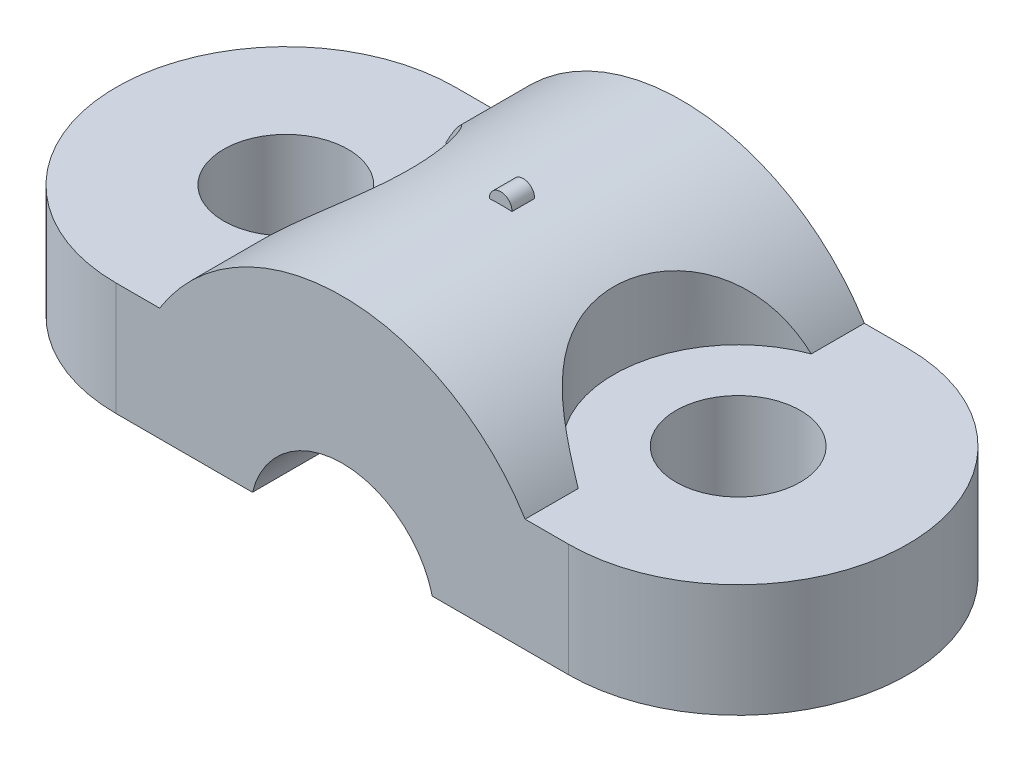
ISO-10303-21;
HEADER;
FILE_DESCRIPTION(('STEP AP214'),'2;1');
FILE_NAME('part.step','',(''),(''),'','','');
FILE_SCHEMA(('AUTOMOTIVE_DESIGN { 1 0 10303 214 1 1 1 1 }'));
ENDSEC;
DATA;
#1=APPLICATION_CONTEXT('core data for automotive mechanical design processes');
#2=APPLICATION_PROTOCOL_DEFINITION('international standard','automotive_design',2000,#1);
#3=PRODUCT_CONTEXT('',#1,'mechanical');
#4=PRODUCT('Part','Part','',(#3));
#5=PRODUCT_RELATED_PRODUCT_CATEGORY('part','',(#4));
#6=PRODUCT_DEFINITION_FORMATION('','',#4);
#7=PRODUCT_DEFINITION_CONTEXT('part definition',#1,'design');
#8=PRODUCT_DEFINITION('design','',#6,#7);
#9=PRODUCT_DEFINITION_SHAPE('','',#8);
#10=(LENGTH_UNIT() NAMED_UNIT(*) SI_UNIT(.MILLI.,.METRE.));
#11=(NAMED_UNIT(*) PLANE_ANGLE_UNIT() SI_UNIT($,.RADIAN.));
#12=(NAMED_UNIT(*) SI_UNIT($,.STERADIAN.) SOLID_ANGLE_UNIT());
#13=UNCERTAINTY_MEASURE_WITH_UNIT(LENGTH_MEASURE(1.E-05),#10,'distance_accuracy_value','');
#14=(GEOMETRIC_REPRESENTATION_CONTEXT(3) GLOBAL_UNCERTAINTY_ASSIGNED_CONTEXT((#13)) GLOBAL_UNIT_ASSIGNED_CONTEXT((#10,
#11,#12)) REPRESENTATION_CONTEXT('',''));
#15=CARTESIAN_POINT('',(0.,0.,0.));
#16=DIRECTION('',(0.,0.,1.));
#17=DIRECTION('',(1.,0.,0.));
#18=AXIS2_PLACEMENT_3D('',#15,#16,#17);
#19=CARTESIAN_POINT('',(0.,0.,0.));
#20=DIRECTION('',(0.,1.,0.));
#21=DIRECTION('',(0.,0.,1.));
#22=AXIS2_PLACEMENT_3D('',#19,#20,#21);
#23=PLANE('',#22);
#24=CARTESIAN_POINT('',(-10.,0.,0.));
#25=DIRECTION('',(0.,1.,0.));
#26=DIRECTION('',(0.,0.,1.));
#27=AXIS2_PLACEMENT_3D('',#24,#25,#26);
#28=CIRCLE('',#27,2.75);
#29=CARTESIAN_POINT('',(-10.,0.,2.75));
#30=VERTEX_POINT('',#29);
#31=EDGE_CURVE('E216',#30,#30,#28,.T.);
#32=ORIENTED_EDGE('',*,*,#31,.T.);
#33=EDGE_LOOP('',(#32));
#34=FACE_BOUND('',#33,.T.);
#35=DIRECTION('',(1.,0.,0.));
#36=VECTOR('',#35,1.);
#37=CARTESIAN_POINT('',(0.,0.,-7.5));
#38=LINE('',#37,#36);
#39=CARTESIAN_POINT('',(-10.,0.,-7.5));
#40=VERTEX_POINT('',#39);
#41=CARTESIAN_POINT('',(-3.97617907041421,0.,-7.5));
#42=VERTEX_POINT('',#41);
#43=EDGE_CURVE('E199',#40,#42,#38,.T.);
#44=ORIENTED_EDGE('',*,*,#43,.T.);
#45=DIRECTION('',(0.,0.,1.));
#46=VECTOR('',#45,1.);
#47=CARTESIAN_POINT('',(-3.97617907041421,0.,-7.5));
#48=LINE('',#47,#46);
#49=CARTESIAN_POINT('',(-3.97617907041421,0.,7.5));
#50=VERTEX_POINT('',#49);
#51=EDGE_CURVE('E148',#42,#50,#48,.T.);
#52=ORIENTED_EDGE('',*,*,#51,.T.);
#53=DIRECTION('',(1.,0.,0.));
#54=VECTOR('',#53,1.);
#55=CARTESIAN_POINT('',(0.,0.,7.5));
#56=LINE('',#55,#54);
#57=CARTESIAN_POINT('',(-10.,0.,7.5));
#58=VERTEX_POINT('',#57);
#59=EDGE_CURVE('E11',#58,#50,#56,.T.);
#60=ORIENTED_EDGE('',*,*,#59,.F.);
#61=CARTESIAN_POINT('',(-10.,0.,0.));
#62=DIRECTION('',(0.,1.,0.));
#63=DIRECTION('',(0.,0.,1.));
#64=AXIS2_PLACEMENT_3D('',#61,#62,#63);
#65=CIRCLE('',#64,7.5);
#66=EDGE_CURVE('E208',#40,#58,#65,.T.);
#67=ORIENTED_EDGE('',*,*,#66,.F.);
#68=EDGE_LOOP('',(#44,#52,#60,#67));
#69=FACE_BOUND('',#68,.T.);
#70=ADVANCED_FACE('F35',(#34,#69),#23,.F.);
#71=CARTESIAN_POINT('',(0.,9.5,-7.5));
#72=DIRECTION('',(0.,0.,-1.));
#73=DIRECTION('',(-1.,0.,0.));
#74=AXIS2_PLACEMENT_3D('',#71,#72,#73);
#75=PLANE('',#74);
#76=CARTESIAN_POINT('',(0.,-0.999999999999999,-7.5));
#77=DIRECTION('',(0.,0.,1.));
#78=DIRECTION('',(1.,0.,0.));
#79=AXIS2_PLACEMENT_3D('',#76,#77,#78);
#80=CIRCLE('',#79,4.1);
#81=CARTESIAN_POINT('',(3.97617907041421,0.,-7.5));
#82=VERTEX_POINT('',#81);
#83=EDGE_CURVE('E143',#82,#42,#80,.T.);
#84=ORIENTED_EDGE('',*,*,#83,.T.);
#85=ORIENTED_EDGE('',*,*,#43,.F.);
#86=DIRECTION('',(0.,-1.,0.));
#87=VECTOR('',#86,1.);
#88=CARTESIAN_POINT('',(-10.,5.,-7.5));
#89=LINE('',#88,#87);
#90=CARTESIAN_POINT('',(-10.,5.,-7.5));
#91=VERTEX_POINT('',#90);
#92=EDGE_CURVE('E209',#91,#40,#89,.T.);
#93=ORIENTED_EDGE('',*,*,#92,.F.);
#94=DIRECTION('',(1.,0.,0.));
#95=VECTOR('',#94,1.);
#96=CARTESIAN_POINT('',(0.,5.,-7.5));
#97=LINE('',#96,#95);
#98=CARTESIAN_POINT('',(-8.08,5.,-7.5));
#99=VERTEX_POINT('',#98);
#100=EDGE_CURVE('E229',#91,#99,#97,.T.);
#101=ORIENTED_EDGE('',*,*,#100,.T.);
#102=CARTESIAN_POINT('',(0.,-0.00404444444444992,-7.5));
#103=DIRECTION('',(0.,0.,1.));
#104=DIRECTION('',(1.,0.,0.));
#105=AXIS2_PLACEMENT_3D('',#102,#103,#104);
#106=CIRCLE('',#105,9.50404444444445);
#107=CARTESIAN_POINT('',(8.08,5.,-7.5));
#108=VERTEX_POINT('',#107);
#109=EDGE_CURVE('E159',#99,#108,#106,.F.);
#110=ORIENTED_EDGE('',*,*,#109,.T.);
#111=DIRECTION('',(1.,0.,0.));
#112=VECTOR('',#111,1.);
#113=CARTESIAN_POINT('',(0.,5.,-7.5));
#114=LINE('',#113,#112);
#115=CARTESIAN_POINT('',(10.,5.,-7.5));
#116=VERTEX_POINT('',#115);
#117=EDGE_CURVE('E250',#108,#116,#114,.T.);
#118=ORIENTED_EDGE('',*,*,#117,.T.);
#119=DIRECTION('',(0.,-1.,0.));
#120=VECTOR('',#119,1.);
#121=CARTESIAN_POINT('',(10.,5.,-7.5));
#122=LINE('',#121,#120);
#123=CARTESIAN_POINT('',(10.,0.,-7.5));
#124=VERTEX_POINT('',#123);
#125=EDGE_CURVE('E240',#116,#124,#122,.T.);
#126=ORIENTED_EDGE('',*,*,#125,.T.);
#127=EDGE_CURVE('E202',#82,#124,#38,.T.);
#128=ORIENTED_EDGE('',*,*,#127,.F.);
#129=EDGE_LOOP('',(#84,#85,#93,#101,#110,#118,#126,#128));
#130=FACE_BOUND('',#129,.T.);
#131=ADVANCED_FACE('F188',(#130),#75,.T.);
#132=CARTESIAN_POINT('',(0.,9.5,7.5));
#133=DIRECTION('',(0.,0.,-1.));
#134=DIRECTION('',(-1.,0.,0.));
#135=AXIS2_PLACEMENT_3D('',#132,#133,#134);
#136=PLANE('',#135);
#137=ORIENTED_EDGE('',*,*,#59,.T.);
#138=CARTESIAN_POINT('',(0.,-0.999999999999999,7.5));
#139=DIRECTION('',(0.,0.,1.));
#140=DIRECTION('',(1.,0.,0.));
#141=AXIS2_PLACEMENT_3D('',#138,#139,#140);
#142=CIRCLE('',#141,4.1);
#143=CARTESIAN_POINT('',(3.97617907041421,0.,7.5));
#144=VERTEX_POINT('',#143);
#145=EDGE_CURVE('E142',#144,#50,#142,.T.);
#146=ORIENTED_EDGE('',*,*,#145,.F.);
#147=CARTESIAN_POINT('',(10.,0.,7.5));
#148=VERTEX_POINT('',#147);
#149=EDGE_CURVE('E44',#144,#148,#56,.T.);
#150=ORIENTED_EDGE('',*,*,#149,.T.);
#151=DIRECTION('',(0.,-1.,0.));
#152=VECTOR('',#151,1.);
#153=CARTESIAN_POINT('',(10.,5.,7.5));
#154=LINE('',#153,#152);
#155=CARTESIAN_POINT('',(10.,5.,7.5));
#156=VERTEX_POINT('',#155);
#157=EDGE_CURVE('E221',#156,#148,#154,.T.);
#158=ORIENTED_EDGE('',*,*,#157,.F.);
#159=DIRECTION('',(1.,0.,0.));
#160=VECTOR('',#159,1.);
#161=CARTESIAN_POINT('',(0.,5.,7.5));
#162=LINE('',#161,#160);
#163=CARTESIAN_POINT('',(8.08,5.,7.5));
#164=VERTEX_POINT('',#163);
#165=EDGE_CURVE('E255',#164,#156,#162,.T.);
#166=ORIENTED_EDGE('',*,*,#165,.F.);
#167=CARTESIAN_POINT('',(0.,-0.00404444444444992,7.5));
#168=DIRECTION('',(0.,0.,1.));
#169=DIRECTION('',(1.,0.,0.));
#170=AXIS2_PLACEMENT_3D('',#167,#168,#169);
#171=CIRCLE('',#170,9.50404444444445);
#172=CARTESIAN_POINT('',(-8.08,5.,7.5));
#173=VERTEX_POINT('',#172);
#174=EDGE_CURVE('E158',#173,#164,#171,.F.);
#175=ORIENTED_EDGE('',*,*,#174,.F.);
#176=DIRECTION('',(1.,0.,0.));
#177=VECTOR('',#176,1.);
#178=CARTESIAN_POINT('',(0.,5.,7.5));
#179=LINE('',#178,#177);
#180=CARTESIAN_POINT('',(-10.,5.,7.5));
#181=VERTEX_POINT('',#180);
#182=EDGE_CURVE('E224',#181,#173,#179,.T.);
#183=ORIENTED_EDGE('',*,*,#182,.F.);
#184=DIRECTION('',(0.,-1.,0.));
#185=VECTOR('',#184,1.);
#186=CARTESIAN_POINT('',(-10.,5.,7.5));
#187=LINE('',#186,#185);
#188=EDGE_CURVE('E212',#181,#58,#187,.T.);
#189=ORIENTED_EDGE('',*,*,#188,.T.);
#190=EDGE_LOOP('',(#137,#146,#150,#158,#166,#175,#183,#189));
#191=FACE_BOUND('',#190,.T.);
#192=ADVANCED_FACE('F186',(#191),#136,.F.);
#193=CARTESIAN_POINT('',(10.,9.5,0.));
#194=DIRECTION('',(0.,-1.,0.));
#195=DIRECTION('',(0.,0.,-1.));
#196=AXIS2_PLACEMENT_3D('',#193,#194,#195);
#197=CYLINDRICAL_SURFACE('',#196,5.5);
#198=CARTESIAN_POINT('',(8.08,5.,5.1539887465923));
#199=CARTESIAN_POINT('',(7.99001563173181,5.14537029095498,5.12045202710558));
#200=CARTESIAN_POINT('',(7.89642080027451,5.2876648416954,5.08291490139109));
#201=CARTESIAN_POINT('',(7.70303619143883,5.56538729143438,4.99851462898592));
#202=CARTESIAN_POINT('',(7.60323825023025,5.70080569622129,4.95163900523841));
#203=CARTESIAN_POINT('',(7.39822899975281,5.96429797844464,4.84706858689315));
#204=CARTESIAN_POINT('',(7.29299392446025,6.09233332444659,4.78932275124168));
#205=CARTESIAN_POINT('',(7.07919423812253,6.33933866324696,4.66201228546329));
#206=CARTESIAN_POINT('',(6.97063158823109,6.4583138569845,4.59245451114239));
#207=CARTESIAN_POINT('',(6.77002561898331,6.66761599596033,4.45304749354069));
#208=CARTESIAN_POINT('',(6.67820013118659,6.75943742939677,4.38512546358434));
#209=CARTESIAN_POINT('',(6.49483287498101,6.93570850535153,4.23998448771444));
#210=CARTESIAN_POINT('',(6.4032910581131,7.02015948250038,4.16276723101617));
#211=CARTESIAN_POINT('',(6.22213791783691,7.18111426267204,3.99907706653871));
#212=CARTESIAN_POINT('',(6.13252200680799,7.25763913011599,3.91262999964637));
#213=CARTESIAN_POINT('',(5.95643697117863,7.40275908901513,3.7303687540728));
#214=CARTESIAN_POINT('',(5.86996780136252,7.47135429444287,3.63455471005909));
#215=CARTESIAN_POINT('',(5.70124719644635,7.60082296141688,3.43337170240056));
#216=CARTESIAN_POINT('',(5.61901839949237,7.66165711328524,3.32795839865091));
#217=CARTESIAN_POINT('',(5.46068184982798,7.77524301032143,3.10851985876541));
#218=CARTESIAN_POINT('',(5.38457425746823,7.8279945437903,2.99449439717768));
#219=CARTESIAN_POINT('',(5.23974783889334,7.92561771971182,2.75847560664738));
#220=CARTESIAN_POINT('',(5.17103605829657,7.97048187357141,2.63647485476747));
#221=CARTESIAN_POINT('',(5.04226321935938,8.05252280833811,2.3855256402096));
#222=CARTESIAN_POINT('',(4.98220169755516,8.08970000114394,2.25657755026534));
#223=CARTESIAN_POINT('',(4.87569571840315,8.15426707913313,2.00227913158619));
#224=CARTESIAN_POINT('',(4.82858229536027,8.18216883107698,1.87733791764317));
#225=CARTESIAN_POINT('',(4.7432772156176,8.23189039517921,1.62321717296968));
#226=CARTESIAN_POINT('',(4.70508867416853,8.25370808419313,1.49403618022434));
#227=CARTESIAN_POINT('',(4.63817572488957,8.29147622530342,1.23249757882539));
#228=CARTESIAN_POINT('',(4.60944532943068,8.30743039014418,1.10014203703577));
#229=CARTESIAN_POINT('',(4.56176669780388,8.33369431090743,0.833080930764921));
#230=CARTESIAN_POINT('',(4.5428218951031,8.34400208575988,0.698374558563418));
#231=CARTESIAN_POINT('',(4.51503828462937,8.35906135478321,0.428380394727918));
#232=CARTESIAN_POINT('',(4.50614357629464,8.36384358648628,0.293100062555013));
#233=CARTESIAN_POINT('',(4.49837528890235,8.36802222045578,0.0221690513639427));
#234=CARTESIAN_POINT('',(4.49950170082585,8.36741862756942,-0.113481627320805));
#235=CARTESIAN_POINT('',(4.51176368608058,8.36081643472608,-0.38422471554139));
#236=CARTESIAN_POINT('',(4.52290120430723,8.35481678645693,-0.519317011474745));
#237=CARTESIAN_POINT('',(4.55505038849556,8.33734097223021,-0.787916170946606));
#238=CARTESIAN_POINT('',(4.57605862016963,8.32586671101677,-0.921423569362649));
#239=CARTESIAN_POINT('',(4.62781292988375,8.29722570836424,-1.1865638287248));
#240=CARTESIAN_POINT('',(4.6586034271825,8.28003298351272,-1.31818521911614));
#241=CARTESIAN_POINT('',(4.72949049511725,8.23976776054407,-1.57792413672532));
#242=CARTESIAN_POINT('',(4.7695835890645,8.21669745875729,-1.70604295302427));
#243=CARTESIAN_POINT('',(4.85856357954256,8.16442428944372,-1.95792604850737));
#244=CARTESIAN_POINT('',(4.90745190221837,8.13522042723227,-2.0816896175919));
#245=CARTESIAN_POINT('',(5.01334827876581,8.07042458381926,-2.32395800884918));
#246=CARTESIAN_POINT('',(5.07035625249683,8.03483266566663,-2.44246288290989));
#247=CARTESIAN_POINT('',(5.19132819405616,7.95724331145843,-2.67273122361642));
#248=CARTESIAN_POINT('',(5.25525007007142,7.91528407191326,-2.7845296835744));
#249=CARTESIAN_POINT('',(5.38938362745487,7.82461791597135,-3.00141201562999));
#250=CARTESIAN_POINT('',(5.45959524542943,7.77591106758035,-3.10649595538424));
#251=CARTESIAN_POINT('',(5.6051944297775,7.67167449225916,-3.30926716864003));
#252=CARTESIAN_POINT('',(5.68057711881361,7.61615115661414,-3.40696123419716));
#253=CARTESIAN_POINT('',(5.83547574864086,7.49819261477784,-3.59465579730305));
#254=CARTESIAN_POINT('',(5.91499314997896,7.43575495724966,-3.68465354610437));
#255=CARTESIAN_POINT('',(6.07793913790115,7.30325823694817,-3.85768486544204));
#256=CARTESIAN_POINT('',(6.16140331673655,7.23311637598895,-3.94062141037416));
#257=CARTESIAN_POINT('',(6.33012485404885,7.086012440228,-4.09821250960134));
#258=CARTESIAN_POINT('',(6.41538237096791,7.00904976085756,-4.17286632842706));
#259=CARTESIAN_POINT('',(6.58670164493307,6.84840333431155,-4.31413384543037));
#260=CARTESIAN_POINT('',(6.67276477776184,6.76470488678345,-4.38072911800364));
#261=CARTESIAN_POINT('',(6.84439122105345,6.59111047836797,-4.50593131531683));
#262=CARTESIAN_POINT('',(6.92995461226864,6.50121555060063,-4.56453956688047));
#263=CARTESIAN_POINT('',(7.11039937051045,6.30381993408541,-4.68115048657111));
#264=CARTESIAN_POINT('',(7.20508286045697,6.1955337381665,-4.73812944608902));
#265=CARTESIAN_POINT('',(7.39139372656363,5.97218594834049,-4.84320317212035));
#266=CARTESIAN_POINT('',(7.48302002866022,5.85712201170591,-4.8912948426942));
#267=CARTESIAN_POINT('',(7.66177586574647,5.62141615772103,-4.97921645036869));
#268=CARTESIAN_POINT('',(7.74892334902326,5.50080089762206,-5.01908167299271));
#269=CARTESIAN_POINT('',(7.91830939750818,5.2542538569602,-5.0916615235222));
#270=CARTESIAN_POINT('',(8.00055221110987,5.12832684372751,-5.12438240717257));
#271=CARTESIAN_POINT('',(8.08,5.,-5.15398874659229));
#272=B_SPLINE_CURVE_WITH_KNOTS('',3,(#198,#199,#200,#201,#202,#203,#204,#205,#206,#207,#208,
#209,#210,#211,#212,#213,#214,#215,#216,#217,#218,#219,#220,#221,#222,#223,#224,#225,#226,#227,
#228,#229,#230,#231,#232,#233,#234,#235,#236,#237,#238,#239,#240,#241,#242,#243,#244,#245,#246,
#247,#248,#249,#250,#251,#252,#253,#254,#255,#256,#257,#258,#259,#260,#261,#262,#263,#264,#265,
#266,#267,#268,#269,#270,#271),.UNSPECIFIED.,.F.,.F.,(4,2,2,2,2,2,2,2,2,2,2,2,2,2,2,2,2,2,2,2,2,
2,2,2,2,2,2,2,2,2,2,2,2,2,2,2,4),(0.,0.522671156148208,1.04604538796136,1.57194135890126,
2.09753312963723,2.5367327541687,2.97585268340231,3.41377393017173,3.85168888194289,
4.29174054629022,4.73180373444884,5.17228250589281,5.61273766856725,6.02148927877775,
6.430383352304,6.83901806893623,7.24779606584504,7.65428899213027,8.06078155257461,
8.46735310093515,8.87378329671269,9.28208603941171,9.69023643093759,10.0984530637356,
10.5066656677327,10.9125197880747,11.3183698183164,11.7238421801669,12.1294587572976,
12.5399647620607,12.9505071888116,13.3619712478386,13.7733668698959,14.237049740574,
14.7008938346784,15.1627050054456,15.624110167645),.UNSPECIFIED.);
#273=CARTESIAN_POINT('',(8.08,5.,5.15398874659229));
#274=VERTEX_POINT('',#273);
#275=CARTESIAN_POINT('',(8.08,5.,-5.15398874659229));
#276=VERTEX_POINT('',#275);
#277=EDGE_CURVE('E151',#274,#276,#272,.T.);
#278=ORIENTED_EDGE('',*,*,#277,.F.);
#279=CARTESIAN_POINT('',(10.,5.,0.));
#280=DIRECTION('',(0.,1.,0.));
#281=DIRECTION('',(0.,0.,1.));
#282=AXIS2_PLACEMENT_3D('',#279,#280,#281);
#283=CIRCLE('',#282,5.5);
#284=EDGE_CURVE('E258',#276,#274,#283,.T.);
#285=ORIENTED_EDGE('',*,*,#284,.F.);
#286=EDGE_LOOP('',(#278,#285));
#287=FACE_BOUND('',#286,.T.);
#288=ADVANCED_FACE('F37',(#287),#197,.F.);
#289=CARTESIAN_POINT('',(-10.,9.5,0.));
#290=DIRECTION('',(0.,-1.,0.));
#291=DIRECTION('',(0.,0.,-1.));
#292=AXIS2_PLACEMENT_3D('',#289,#290,#291);
#293=CYLINDRICAL_SURFACE('',#292,5.5);
#294=CARTESIAN_POINT('',(-8.08,5.,-5.15398874659229));
#295=CARTESIAN_POINT('',(-7.99001563173182,5.14537029095499,-5.12045202710558));
#296=CARTESIAN_POINT('',(-7.89642080027452,5.28766484169541,-5.08291490139109));
#297=CARTESIAN_POINT('',(-7.70303619143883,5.56538729143438,-4.99851462898592));
#298=CARTESIAN_POINT('',(-7.60323825023026,5.7008056962213,-4.95163900523841));
#299=CARTESIAN_POINT('',(-7.39822899975281,5.96429797844465,-4.84706858689314));
#300=CARTESIAN_POINT('',(-7.29299392446025,6.09233332444659,-4.78932275124168));
#301=CARTESIAN_POINT('',(-7.07919423812253,6.33933866324696,-4.66201228546328));
#302=CARTESIAN_POINT('',(-6.9706315882311,6.45831385698451,-4.59245451114239));
#303=CARTESIAN_POINT('',(-6.77002561898331,6.66761599596033,-4.45304749354069));
#304=CARTESIAN_POINT('',(-6.67820013118659,6.75943742939678,-4.38512546358434));
#305=CARTESIAN_POINT('',(-6.49483287498101,6.93570850535153,-4.23998448771444));
#306=CARTESIAN_POINT('',(-6.4032910581131,7.02015948250038,-4.16276723101617));
#307=CARTESIAN_POINT('',(-6.22213791783691,7.18111426267204,-3.9990770665387));
#308=CARTESIAN_POINT('',(-6.13252200680799,7.25763913011599,-3.91262999964637));
#309=CARTESIAN_POINT('',(-5.95643697117864,7.40275908901513,-3.7303687540728));
#310=CARTESIAN_POINT('',(-5.86996780136253,7.47135429444287,-3.63455471005909));
#311=CARTESIAN_POINT('',(-5.70124719644635,7.60082296141688,-3.43337170240056));
#312=CARTESIAN_POINT('',(-5.61901839949237,7.66165711328524,-3.32795839865091));
#313=CARTESIAN_POINT('',(-5.46068184982799,7.77524301032144,-3.10851985876541));
#314=CARTESIAN_POINT('',(-5.38457425746824,7.8279945437903,-2.99449439717768));
#315=CARTESIAN_POINT('',(-5.23974783889334,7.92561771971182,-2.75847560664738));
#316=CARTESIAN_POINT('',(-5.17103605829658,7.97048187357141,-2.63647485476747));
#317=CARTESIAN_POINT('',(-5.04226321935938,8.05252280833811,-2.3855256402096));
#318=CARTESIAN_POINT('',(-4.98220169755516,8.08970000114394,-2.25657755026534));
#319=CARTESIAN_POINT('',(-4.87569571840315,8.15426707913313,-2.0022791315862));
#320=CARTESIAN_POINT('',(-4.82858229536027,8.18216883107698,-1.87733791764317));
#321=CARTESIAN_POINT('',(-4.74327721561761,8.23189039517922,-1.62321717296969));
#322=CARTESIAN_POINT('',(-4.70508867416853,8.25370808419313,-1.49403618022434));
#323=CARTESIAN_POINT('',(-4.63817572488957,8.29147622530342,-1.2324975788254));
#324=CARTESIAN_POINT('',(-4.60944532943068,8.30743039014418,-1.10014203703578));
#325=CARTESIAN_POINT('',(-4.56176669780389,8.33369431090743,-0.833080930764929));
#326=CARTESIAN_POINT('',(-4.5428218951031,8.34400208575988,-0.698374558563427));
#327=CARTESIAN_POINT('',(-4.51503828462937,8.35906135478321,-0.428380394727927));
#328=CARTESIAN_POINT('',(-4.50614357629464,8.36384358648628,-0.293100062555022));
#329=CARTESIAN_POINT('',(-4.49837528890235,8.36802222045578,-0.0221690513639521));
#330=CARTESIAN_POINT('',(-4.49950170082585,8.36741862756942,0.113481627320795));
#331=CARTESIAN_POINT('',(-4.51176368608058,8.36081643472609,0.384224715541381));
#332=CARTESIAN_POINT('',(-4.52290120430723,8.35481678645693,0.519317011474737));
#333=CARTESIAN_POINT('',(-4.55505038849556,8.33734097223022,0.787916170946599));
#334=CARTESIAN_POINT('',(-4.57605862016964,8.32586671101678,0.921423569362642));
#335=CARTESIAN_POINT('',(-4.62781292988375,8.29722570836424,1.18656382872479));
#336=CARTESIAN_POINT('',(-4.6586034271825,8.28003298351273,1.31818521911613));
#337=CARTESIAN_POINT('',(-4.72949049511725,8.23976776054407,1.57792413672531));
#338=CARTESIAN_POINT('',(-4.7695835890645,8.21669745875729,1.70604295302426));
#339=CARTESIAN_POINT('',(-4.85856357954256,8.16442428944372,1.95792604850737));
#340=CARTESIAN_POINT('',(-4.90745190221837,8.13522042723227,2.08168961759189));
#341=CARTESIAN_POINT('',(-5.01334827876581,8.07042458381927,2.32395800884917));
#342=CARTESIAN_POINT('',(-5.07035625249683,8.03483266566664,2.44246288290988));
#343=CARTESIAN_POINT('',(-5.19132819405616,7.95724331145843,2.67273122361641));
#344=CARTESIAN_POINT('',(-5.25525007007141,7.91528407191326,2.7845296835744));
#345=CARTESIAN_POINT('',(-5.38938362745487,7.82461791597136,3.00141201562998));
#346=CARTESIAN_POINT('',(-5.45959524542943,7.77591106758036,3.10649595538423));
#347=CARTESIAN_POINT('',(-5.6051944297775,7.67167449225917,3.30926716864003));
#348=CARTESIAN_POINT('',(-5.68057711881361,7.61615115661414,3.40696123419715));
#349=CARTESIAN_POINT('',(-5.83547574864086,7.49819261477785,3.59465579730305));
#350=CARTESIAN_POINT('',(-5.91499314997896,7.43575495724967,3.68465354610436));
#351=CARTESIAN_POINT('',(-6.07793913790115,7.30325823694818,3.85768486544203));
#352=CARTESIAN_POINT('',(-6.16140331673655,7.23311637598896,3.94062141037416));
#353=CARTESIAN_POINT('',(-6.33012485404885,7.086012440228,4.09821250960133));
#354=CARTESIAN_POINT('',(-6.4153823709679,7.00904976085757,4.17286632842706));
#355=CARTESIAN_POINT('',(-6.58670164493307,6.84840333431156,4.31413384543037));
#356=CARTESIAN_POINT('',(-6.67276477776184,6.76470488678345,4.38072911800364));
#357=CARTESIAN_POINT('',(-6.84439122105345,6.59111047836798,4.50593131531683));
#358=CARTESIAN_POINT('',(-6.92995461226863,6.50121555060064,4.56453956688047));
#359=CARTESIAN_POINT('',(-7.11039937051045,6.30381993408542,4.68115048657111));
#360=CARTESIAN_POINT('',(-7.20508286045697,6.19553373816651,4.73812944608902));
#361=CARTESIAN_POINT('',(-7.39139372656363,5.9721859483405,4.84320317212035));
#362=CARTESIAN_POINT('',(-7.48302002866022,5.85712201170592,4.8912948426942));
#363=CARTESIAN_POINT('',(-7.66177586574647,5.62141615772104,4.97921645036869));
#364=CARTESIAN_POINT('',(-7.74892334902326,5.50080089762206,5.01908167299271));
#365=CARTESIAN_POINT('',(-7.91830939750818,5.25425385696021,5.0916615235222));
#366=CARTESIAN_POINT('',(-8.00055221110987,5.12832684372751,5.12438240717257));
#367=CARTESIAN_POINT('',(-8.08,5.,5.15398874659229));
#368=B_SPLINE_CURVE_WITH_KNOTS('',3,(#294,#295,#296,#297,#298,#299,#300,#301,#302,#303,#304,
#305,#306,#307,#308,#309,#310,#311,#312,#313,#314,#315,#316,#317,#318,#319,#320,#321,#322,#323,
#324,#325,#326,#327,#328,#329,#330,#331,#332,#333,#334,#335,#336,#337,#338,#339,#340,#341,#342,
#343,#344,#345,#346,#347,#348,#349,#350,#351,#352,#353,#354,#355,#356,#357,#358,#359,#360,#361,
#362,#363,#364,#365,#366,#367),.UNSPECIFIED.,.F.,.F.,(4,2,2,2,2,2,2,2,2,2,2,2,2,2,2,2,2,2,2,2,2,
2,2,2,2,2,2,2,2,2,2,2,2,2,2,2,4),(0.,0.522671156148207,1.04604538796136,1.57194135890126,
2.09753312963723,2.53673275416869,2.9758526834023,3.41377393017173,3.85168888194288,
4.29174054629021,4.73180373444883,5.1722825058928,5.61273766856724,6.02148927877773,
6.43038335230398,6.83901806893622,7.24779606584503,7.65428899213026,8.0607815525746,
8.46735310093514,8.87378329671268,9.2820860394117,9.69023643093758,10.0984530637356,
10.5066656677327,10.9125197880747,11.3183698183164,11.7238421801669,12.1294587572976,
12.5399647620607,12.9505071888116,13.3619712478386,13.7733668698959,14.237049740574,
14.7008938346784,15.1627050054456,15.624110167645),.UNSPECIFIED.);
#369=CARTESIAN_POINT('',(-8.08,5.,-5.15398874659229));
#370=VERTEX_POINT('',#369);
#371=CARTESIAN_POINT('',(-8.08,5.,5.15398874659229));
#372=VERTEX_POINT('',#371);
#373=EDGE_CURVE('E171',#370,#372,#368,.T.);
#374=ORIENTED_EDGE('',*,*,#373,.F.);
#375=CARTESIAN_POINT('',(-10.,5.,0.));
#376=DIRECTION('',(0.,1.,0.));
#377=DIRECTION('',(0.,0.,1.));
#378=AXIS2_PLACEMENT_3D('',#375,#376,#377);
#379=CIRCLE('',#378,5.5);
#380=EDGE_CURVE('E234',#372,#370,#379,.T.);
#381=ORIENTED_EDGE('',*,*,#380,.F.);
#382=EDGE_LOOP('',(#374,#381));
#383=FACE_BOUND('',#382,.T.);
#384=ADVANCED_FACE('F180',(#383),#293,.F.);
#385=ORIENTED_EDGE('',*,*,#149,.F.);
#386=DIRECTION('',(0.,0.,1.));
#387=VECTOR('',#386,1.);
#388=CARTESIAN_POINT('',(3.97617907041421,0.,-7.5));
#389=LINE('',#388,#387);
#390=EDGE_CURVE('E146',#82,#144,#389,.T.);
#391=ORIENTED_EDGE('',*,*,#390,.F.);
#392=ORIENTED_EDGE('',*,*,#127,.T.);
#393=CARTESIAN_POINT('',(10.,0.,0.));
#394=DIRECTION('',(0.,1.,0.));
#395=DIRECTION('',(0.,0.,1.));
#396=AXIS2_PLACEMENT_3D('',#393,#394,#395);
#397=CIRCLE('',#396,7.5);
#398=EDGE_CURVE('E177',#148,#124,#397,.T.);
#399=ORIENTED_EDGE('',*,*,#398,.F.);
#400=EDGE_LOOP('',(#385,#391,#392,#399));
#401=FACE_BOUND('',#400,.T.);
#402=CARTESIAN_POINT('',(10.,0.,0.));
#403=DIRECTION('',(0.,1.,0.));
#404=DIRECTION('',(0.,0.,1.));
#405=AXIS2_PLACEMENT_3D('',#402,#403,#404);
#406=CIRCLE('',#405,2.75);
#407=CARTESIAN_POINT('',(10.,0.,2.75));
#408=VERTEX_POINT('',#407);
#409=EDGE_CURVE('E243',#408,#408,#406,.T.);
#410=ORIENTED_EDGE('',*,*,#409,.T.);
#411=EDGE_LOOP('',(#410));
#412=FACE_BOUND('',#411,.T.);
#413=ADVANCED_FACE('F184',(#401,#412),#23,.F.);
#414=CARTESIAN_POINT('',(-10.,5.,0.));
#415=DIRECTION('',(0.,-1.,0.));
#416=DIRECTION('',(0.,0.,-1.));
#417=AXIS2_PLACEMENT_3D('',#414,#415,#416);
#418=CYLINDRICAL_SURFACE('',#417,7.5);
#419=ORIENTED_EDGE('',*,*,#66,.T.);
#420=ORIENTED_EDGE('',*,*,#188,.F.);
#421=CARTESIAN_POINT('',(-10.,5.,0.));
#422=DIRECTION('',(0.,1.,0.));
#423=DIRECTION('',(0.,0.,1.));
#424=AXIS2_PLACEMENT_3D('',#421,#422,#423);
#425=CIRCLE('',#424,7.5);
#426=EDGE_CURVE('E227',#91,#181,#425,.T.);
#427=ORIENTED_EDGE('',*,*,#426,.F.);
#428=ORIENTED_EDGE('',*,*,#92,.T.);
#429=EDGE_LOOP('',(#419,#420,#427,#428));
#430=FACE_BOUND('',#429,.T.);
#431=ADVANCED_FACE('F284',(#430),#418,.T.);
#432=CARTESIAN_POINT('',(-10.,5.,0.));
#433=DIRECTION('',(0.,-1.,0.));
#434=DIRECTION('',(0.,0.,-1.));
#435=AXIS2_PLACEMENT_3D('',#432,#433,#434);
#436=CYLINDRICAL_SURFACE('',#435,2.75);
#437=CARTESIAN_POINT('',(-10.,5.,0.));
#438=DIRECTION('',(0.,1.,0.));
#439=DIRECTION('',(0.,0.,1.));
#440=AXIS2_PLACEMENT_3D('',#437,#438,#439);
#441=CIRCLE('',#440,2.75);
#442=CARTESIAN_POINT('',(-10.,5.,2.75));
#443=VERTEX_POINT('',#442);
#444=EDGE_CURVE('E215',#443,#443,#441,.T.);
#445=ORIENTED_EDGE('',*,*,#444,.T.);
#446=EDGE_LOOP('',(#445));
#447=FACE_BOUND('',#446,.T.);
#448=ORIENTED_EDGE('',*,*,#31,.F.);
#449=EDGE_LOOP('',(#448));
#450=FACE_BOUND('',#449,.T.);
#451=ADVANCED_FACE('F292',(#447,#450),#436,.F.);
#452=CARTESIAN_POINT('',(0.,5.,0.));
#453=DIRECTION('',(0.,1.,0.));
#454=DIRECTION('',(0.,0.,1.));
#455=AXIS2_PLACEMENT_3D('',#452,#453,#454);
#456=PLANE('',#455);
#457=ORIENTED_EDGE('',*,*,#444,.F.);
#458=EDGE_LOOP('',(#457));
#459=FACE_BOUND('',#458,.T.);
#460=DIRECTION('',(0.,0.,1.));
#461=VECTOR('',#460,1.);
#462=CARTESIAN_POINT('',(-8.08,5.,0.));
#463=LINE('',#462,#461);
#464=EDGE_CURVE('E219',#372,#173,#463,.T.);
#465=ORIENTED_EDGE('',*,*,#464,.F.);
#466=ORIENTED_EDGE('',*,*,#380,.T.);
#467=DIRECTION('',(0.,0.,1.));
#468=VECTOR('',#467,1.);
#469=CARTESIAN_POINT('',(-8.08,5.,0.));
#470=LINE('',#469,#468);
#471=EDGE_CURVE('E232',#99,#370,#470,.T.);
#472=ORIENTED_EDGE('',*,*,#471,.F.);
#473=ORIENTED_EDGE('',*,*,#100,.F.);
#474=ORIENTED_EDGE('',*,*,#426,.T.);
#475=ORIENTED_EDGE('',*,*,#182,.T.);
#476=EDGE_LOOP('',(#465,#466,#472,#473,#474,#475));
#477=FACE_BOUND('',#476,.T.);
#478=ADVANCED_FACE('F300',(#459,#477),#456,.T.);
#479=CARTESIAN_POINT('',(10.,5.,0.));
#480=DIRECTION('',(0.,-1.,0.));
#481=DIRECTION('',(0.,0.,-1.));
#482=AXIS2_PLACEMENT_3D('',#479,#480,#481);
#483=CYLINDRICAL_SURFACE('',#482,7.5);
#484=ORIENTED_EDGE('',*,*,#398,.T.);
#485=ORIENTED_EDGE('',*,*,#125,.F.);
#486=CARTESIAN_POINT('',(10.,5.,0.));
#487=DIRECTION('',(0.,1.,0.));
#488=DIRECTION('',(0.,0.,1.));
#489=AXIS2_PLACEMENT_3D('',#486,#487,#488);
#490=CIRCLE('',#489,7.5);
#491=EDGE_CURVE('E253',#156,#116,#490,.T.);
#492=ORIENTED_EDGE('',*,*,#491,.F.);
#493=ORIENTED_EDGE('',*,*,#157,.T.);
#494=EDGE_LOOP('',(#484,#485,#492,#493));
#495=FACE_BOUND('',#494,.T.);
#496=ADVANCED_FACE('F308',(#495),#483,.T.);
#497=CARTESIAN_POINT('',(10.,5.,0.));
#498=DIRECTION('',(0.,-1.,0.));
#499=DIRECTION('',(0.,0.,-1.));
#500=AXIS2_PLACEMENT_3D('',#497,#498,#499);
#501=CYLINDRICAL_SURFACE('',#500,2.75);
#502=CARTESIAN_POINT('',(10.,5.,0.));
#503=DIRECTION('',(0.,1.,0.));
#504=DIRECTION('',(0.,0.,1.));
#505=AXIS2_PLACEMENT_3D('',#502,#503,#504);
#506=CIRCLE('',#505,2.75);
#507=CARTESIAN_POINT('',(10.,5.,2.75));
#508=VERTEX_POINT('',#507);
#509=EDGE_CURVE('E242',#508,#508,#506,.T.);
#510=ORIENTED_EDGE('',*,*,#509,.T.);
#511=EDGE_LOOP('',(#510));
#512=FACE_BOUND('',#511,.T.);
#513=ORIENTED_EDGE('',*,*,#409,.F.);
#514=EDGE_LOOP('',(#513));
#515=FACE_BOUND('',#514,.T.);
#516=ADVANCED_FACE('F316',(#512,#515),#501,.F.);
#517=CARTESIAN_POINT('',(0.,5.,0.));
#518=DIRECTION('',(0.,1.,0.));
#519=DIRECTION('',(0.,0.,1.));
#520=AXIS2_PLACEMENT_3D('',#517,#518,#519);
#521=PLANE('',#520);
#522=ORIENTED_EDGE('',*,*,#509,.F.);
#523=EDGE_LOOP('',(#522));
#524=FACE_BOUND('',#523,.T.);
#525=DIRECTION('',(0.,0.,1.));
#526=VECTOR('',#525,1.);
#527=CARTESIAN_POINT('',(8.08,5.,0.));
#528=LINE('',#527,#526);
#529=EDGE_CURVE('E178',#108,#276,#528,.T.);
#530=ORIENTED_EDGE('',*,*,#529,.T.);
#531=ORIENTED_EDGE('',*,*,#284,.T.);
#532=DIRECTION('',(0.,0.,-1.));
#533=VECTOR('',#532,1.);
#534=CARTESIAN_POINT('',(8.08,5.,0.));
#535=LINE('',#534,#533);
#536=EDGE_CURVE('E257',#164,#274,#535,.T.);
#537=ORIENTED_EDGE('',*,*,#536,.F.);
#538=ORIENTED_EDGE('',*,*,#165,.T.);
#539=ORIENTED_EDGE('',*,*,#491,.T.);
#540=ORIENTED_EDGE('',*,*,#117,.F.);
#541=EDGE_LOOP('',(#530,#531,#537,#538,#539,#540));
#542=FACE_BOUND('',#541,.T.);
#543=ADVANCED_FACE('F166',(#524,#542),#521,.T.);
#544=CARTESIAN_POINT('',(0.,-0.00404444444444992,-7.5));
#545=DIRECTION('',(0.,0.,1.));
#546=DIRECTION('',(1.,0.,0.));
#547=AXIS2_PLACEMENT_3D('',#544,#545,#546);
#548=CYLINDRICAL_SURFACE('',#547,9.50404444444445);
#549=DIRECTION('',(0.,0.,-1.));
#550=VECTOR('',#549,1.);
#551=CARTESIAN_POINT('',(0.499826987192359,9.48684770460295,0.5));
#552=LINE('',#551,#550);
#553=CARTESIAN_POINT('',(0.499826987192355,9.48684770460295,0.5));
#554=VERTEX_POINT('',#553);
#555=CARTESIAN_POINT('',(0.499826987192359,9.48684770460295,-0.5));
#556=VERTEX_POINT('',#555);
#557=EDGE_CURVE('E56',#554,#556,#552,.T.);
#558=ORIENTED_EDGE('',*,*,#557,.F.);
#559=CARTESIAN_POINT('',(0.,-0.00404444444444992,0.5));
#560=DIRECTION('',(0.,0.,1.));
#561=DIRECTION('',(1.,0.,0.));
#562=AXIS2_PLACEMENT_3D('',#559,#560,#561);
#563=CIRCLE('',#562,9.50404444444445);
#564=CARTESIAN_POINT('',(-0.499826987192359,9.48684770460295,0.5));
#565=VERTEX_POINT('',#564);
#566=EDGE_CURVE('E51',#554,#565,#563,.T.);
#567=ORIENTED_EDGE('',*,*,#566,.T.);
#568=DIRECTION('',(0.,0.,-1.));
#569=VECTOR('',#568,1.);
#570=CARTESIAN_POINT('',(-0.499826987192363,9.48684770460295,0.5));
#571=LINE('',#570,#569);
#572=CARTESIAN_POINT('',(-0.499826987192363,9.48684770460295,-0.5));
#573=VERTEX_POINT('',#572);
#574=EDGE_CURVE('E122',#565,#573,#571,.T.);
#575=ORIENTED_EDGE('',*,*,#574,.T.);
#576=CARTESIAN_POINT('',(0.,-0.00404444444444992,-0.5));
#577=DIRECTION('',(0.,0.,1.));
#578=DIRECTION('',(1.,0.,0.));
#579=AXIS2_PLACEMENT_3D('',#576,#577,#578);
#580=CIRCLE('',#579,9.50404444444445);
#581=EDGE_CURVE('E127',#556,#573,#580,.T.);
#582=ORIENTED_EDGE('',*,*,#581,.F.);
#583=EDGE_LOOP('',(#558,#567,#575,#582));
#584=FACE_BOUND('',#583,.T.);
#585=ORIENTED_EDGE('',*,*,#373,.T.);
#586=ORIENTED_EDGE('',*,*,#464,.T.);
#587=ORIENTED_EDGE('',*,*,#174,.T.);
#588=ORIENTED_EDGE('',*,*,#536,.T.);
#589=ORIENTED_EDGE('',*,*,#277,.T.);
#590=ORIENTED_EDGE('',*,*,#529,.F.);
#591=ORIENTED_EDGE('',*,*,#109,.F.);
#592=ORIENTED_EDGE('',*,*,#471,.T.);
#593=EDGE_LOOP('',(#585,#586,#587,#588,#589,#590,#591,#592));
#594=FACE_BOUND('',#593,.T.);
#595=ADVANCED_FACE('F124',(#584,#594),#548,.T.);
#596=CARTESIAN_POINT('',(0.,-0.999999999999999,-7.5));
#597=DIRECTION('',(0.,0.,1.));
#598=DIRECTION('',(1.,0.,0.));
#599=AXIS2_PLACEMENT_3D('',#596,#597,#598);
#600=CYLINDRICAL_SURFACE('',#599,4.1);
#601=ORIENTED_EDGE('',*,*,#145,.T.);
#602=ORIENTED_EDGE('',*,*,#51,.F.);
#603=ORIENTED_EDGE('',*,*,#83,.F.);
#604=ORIENTED_EDGE('',*,*,#390,.T.);
#605=EDGE_LOOP('',(#601,#602,#603,#604));
#606=FACE_BOUND('',#605,.T.);
#607=ADVANCED_FACE('F165',(#606),#600,.F.);
#608=CARTESIAN_POINT('',(0.,9.5,0.5));
#609=DIRECTION('',(0.,0.,-1.));
#610=DIRECTION('',(-1.,0.,0.));
#611=AXIS2_PLACEMENT_3D('',#608,#609,#610);
#612=CYLINDRICAL_SURFACE('',#611,0.5);
#613=CARTESIAN_POINT('',(0.,9.5,-0.5));
#614=DIRECTION('',(0.,0.,1.));
#615=DIRECTION('',(1.,0.,0.));
#616=AXIS2_PLACEMENT_3D('',#613,#614,#615);
#617=CIRCLE('',#616,0.5);
#618=EDGE_CURVE('E132',#556,#573,#617,.T.);
#619=ORIENTED_EDGE('',*,*,#618,.T.);
#620=ORIENTED_EDGE('',*,*,#574,.F.);
#621=CARTESIAN_POINT('',(0.,9.5,0.5));
#622=DIRECTION('',(0.,0.,1.));
#623=DIRECTION('',(1.,0.,0.));
#624=AXIS2_PLACEMENT_3D('',#621,#622,#623);
#625=CIRCLE('',#624,0.5);
#626=EDGE_CURVE('E129',#554,#565,#625,.T.);
#627=ORIENTED_EDGE('',*,*,#626,.F.);
#628=ORIENTED_EDGE('',*,*,#557,.T.);
#629=EDGE_LOOP('',(#619,#620,#627,#628));
#630=FACE_BOUND('',#629,.T.);
#631=ADVANCED_FACE('F133',(#630),#612,.T.);
#632=CARTESIAN_POINT('',(0.,0.,0.5));
#633=DIRECTION('',(0.,0.,1.));
#634=DIRECTION('',(1.,0.,0.));
#635=AXIS2_PLACEMENT_3D('',#632,#633,#634);
#636=PLANE('',#635);
#637=ORIENTED_EDGE('',*,*,#566,.F.);
#638=ORIENTED_EDGE('',*,*,#626,.T.);
#639=EDGE_LOOP('',(#637,#638));
#640=FACE_BOUND('',#639,.T.);
#641=ADVANCED_FACE('F348',(#640),#636,.T.);
#642=CARTESIAN_POINT('',(0.,0.,-0.5));
#643=DIRECTION('',(0.,0.,1.));
#644=DIRECTION('',(1.,0.,0.));
#645=AXIS2_PLACEMENT_3D('',#642,#643,#644);
#646=PLANE('',#645);
#647=ORIENTED_EDGE('',*,*,#581,.T.);
#648=ORIENTED_EDGE('',*,*,#618,.F.);
#649=EDGE_LOOP('',(#647,#648));
#650=FACE_BOUND('',#649,.T.);
#651=ADVANCED_FACE('F136',(#650),#646,.F.);
#652=CLOSED_SHELL('',(#70,#131,#192,#288,#384,#413,#431,#451,#478,#496,#516,#543,#595,#607,#631,
#641,#651));
#653=MANIFOLD_SOLID_BREP('B2',#652);
#654=ADVANCED_BREP_SHAPE_REPRESENTATION('',(#18,#653),#14);
#655=SHAPE_DEFINITION_REPRESENTATION(#9,#654);
ENDSEC;
END-ISO-10303-21;
